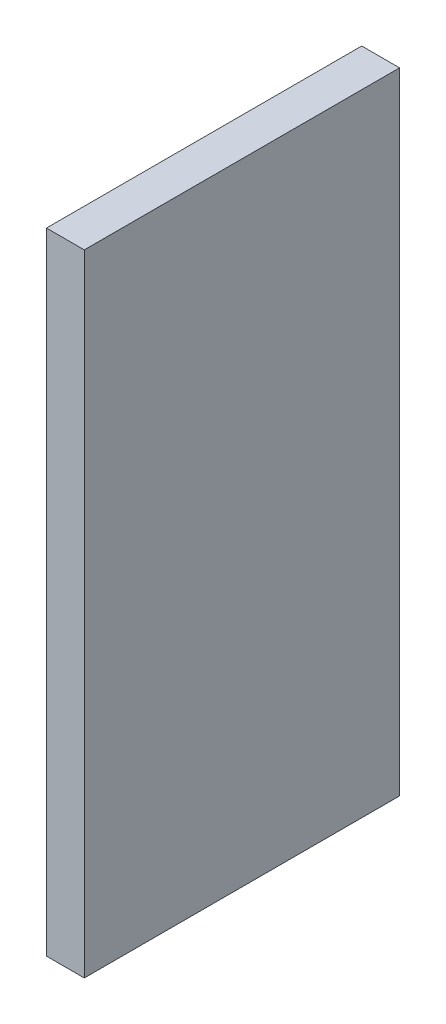
ISO-10303-21;
HEADER;
FILE_DESCRIPTION(('STEP AP214'),'2;1');
FILE_NAME('part.step','',(''),(''),'','','');
FILE_SCHEMA(('AUTOMOTIVE_DESIGN { 1 0 10303 214 1 1 1 1 }'));
ENDSEC;
DATA;
#1=APPLICATION_CONTEXT('core data for automotive mechanical design processes');
#2=APPLICATION_PROTOCOL_DEFINITION('international standard','automotive_design',2000,#1);
#3=PRODUCT_CONTEXT('',#1,'mechanical');
#4=PRODUCT('Part','Part','',(#3));
#5=PRODUCT_RELATED_PRODUCT_CATEGORY('part','',(#4));
#6=PRODUCT_DEFINITION_FORMATION('','',#4);
#7=PRODUCT_DEFINITION_CONTEXT('part definition',#1,'design');
#8=PRODUCT_DEFINITION('design','',#6,#7);
#9=PRODUCT_DEFINITION_SHAPE('','',#8);
#10=(LENGTH_UNIT() NAMED_UNIT(*) SI_UNIT(.MILLI.,.METRE.));
#11=(NAMED_UNIT(*) PLANE_ANGLE_UNIT() SI_UNIT($,.RADIAN.));
#12=(NAMED_UNIT(*) SI_UNIT($,.STERADIAN.) SOLID_ANGLE_UNIT());
#13=UNCERTAINTY_MEASURE_WITH_UNIT(LENGTH_MEASURE(1.E-05),#10,'distance_accuracy_value','');
#14=(GEOMETRIC_REPRESENTATION_CONTEXT(3) GLOBAL_UNCERTAINTY_ASSIGNED_CONTEXT((#13)) GLOBAL_UNIT_ASSIGNED_CONTEXT((#10,
#11,#12)) REPRESENTATION_CONTEXT('',''));
#15=CARTESIAN_POINT('',(0.,0.,0.));
#16=DIRECTION('',(0.,0.,1.));
#17=DIRECTION('',(1.,0.,0.));
#18=AXIS2_PLACEMENT_3D('',#15,#16,#17);
#19=CARTESIAN_POINT('',(3.,-25.,12.5));
#20=DIRECTION('',(0.,0.,-1.));
#21=DIRECTION('',(-1.,0.,0.));
#22=AXIS2_PLACEMENT_3D('',#19,#20,#21);
#23=PLANE('',#22);
#24=DIRECTION('',(0.,-1.,0.));
#25=VECTOR('',#24,1.);
#26=CARTESIAN_POINT('',(0.,-25.,12.5));
#27=LINE('',#26,#25);
#28=CARTESIAN_POINT('',(0.,25.,12.5));
#29=VERTEX_POINT('',#28);
#30=CARTESIAN_POINT('',(0.,-25.,12.5));
#31=VERTEX_POINT('',#30);
#32=EDGE_CURVE('E111',#29,#31,#27,.T.);
#33=ORIENTED_EDGE('',*,*,#32,.T.);
#34=DIRECTION('',(-1.,0.,0.));
#35=VECTOR('',#34,1.);
#36=CARTESIAN_POINT('',(3.,-25.,12.5));
#37=LINE('',#36,#35);
#38=CARTESIAN_POINT('',(3.,-25.,12.5));
#39=VERTEX_POINT('',#38);
#40=EDGE_CURVE('E11',#39,#31,#37,.T.);
#41=ORIENTED_EDGE('',*,*,#40,.F.);
#42=DIRECTION('',(0.,-1.,0.));
#43=VECTOR('',#42,1.);
#44=CARTESIAN_POINT('',(3.,-25.,12.5));
#45=LINE('',#44,#43);
#46=CARTESIAN_POINT('',(3.,25.,12.5));
#47=VERTEX_POINT('',#46);
#48=EDGE_CURVE('E95',#47,#39,#45,.T.);
#49=ORIENTED_EDGE('',*,*,#48,.F.);
#50=DIRECTION('',(-1.,0.,0.));
#51=VECTOR('',#50,1.);
#52=CARTESIAN_POINT('',(3.,25.,12.5));
#53=LINE('',#52,#51);
#54=EDGE_CURVE('E107',#47,#29,#53,.T.);
#55=ORIENTED_EDGE('',*,*,#54,.T.);
#56=EDGE_LOOP('',(#33,#41,#49,#55));
#57=FACE_BOUND('',#56,.T.);
#58=ADVANCED_FACE('F43',(#57),#23,.F.);
#59=CARTESIAN_POINT('',(3.,-25.,-12.5));
#60=DIRECTION('',(0.,1.,0.));
#61=DIRECTION('',(0.,0.,1.));
#62=AXIS2_PLACEMENT_3D('',#59,#60,#61);
#63=PLANE('',#62);
#64=DIRECTION('',(0.,0.,-1.));
#65=VECTOR('',#64,1.);
#66=CARTESIAN_POINT('',(0.,-25.,-12.5));
#67=LINE('',#66,#65);
#68=CARTESIAN_POINT('',(0.,-25.,-12.5));
#69=VERTEX_POINT('',#68);
#70=EDGE_CURVE('E100',#31,#69,#67,.T.);
#71=ORIENTED_EDGE('',*,*,#70,.T.);
#72=DIRECTION('',(-1.,0.,0.));
#73=VECTOR('',#72,1.);
#74=CARTESIAN_POINT('',(3.,-25.,-12.5));
#75=LINE('',#74,#73);
#76=CARTESIAN_POINT('',(3.,-25.,-12.5));
#77=VERTEX_POINT('',#76);
#78=EDGE_CURVE('E52',#77,#69,#75,.T.);
#79=ORIENTED_EDGE('',*,*,#78,.F.);
#80=DIRECTION('',(0.,0.,-1.));
#81=VECTOR('',#80,1.);
#82=CARTESIAN_POINT('',(3.,-25.,-12.5));
#83=LINE('',#82,#81);
#84=EDGE_CURVE('E90',#39,#77,#83,.T.);
#85=ORIENTED_EDGE('',*,*,#84,.F.);
#86=ORIENTED_EDGE('',*,*,#40,.T.);
#87=EDGE_LOOP('',(#71,#79,#85,#86));
#88=FACE_BOUND('',#87,.T.);
#89=ADVANCED_FACE('F99',(#88),#63,.F.);
#90=CARTESIAN_POINT('',(3.,-25.,-12.5));
#91=DIRECTION('',(0.,0.,1.));
#92=DIRECTION('',(1.,0.,0.));
#93=AXIS2_PLACEMENT_3D('',#90,#91,#92);
#94=PLANE('',#93);
#95=DIRECTION('',(0.,1.,0.));
#96=VECTOR('',#95,1.);
#97=CARTESIAN_POINT('',(0.,-25.,-12.5));
#98=LINE('',#97,#96);
#99=CARTESIAN_POINT('',(0.,25.,-12.5));
#100=VERTEX_POINT('',#99);
#101=EDGE_CURVE('E77',#69,#100,#98,.T.);
#102=ORIENTED_EDGE('',*,*,#101,.T.);
#103=DIRECTION('',(-1.,0.,0.));
#104=VECTOR('',#103,1.);
#105=CARTESIAN_POINT('',(3.,25.,-12.5));
#106=LINE('',#105,#104);
#107=CARTESIAN_POINT('',(3.,25.,-12.5));
#108=VERTEX_POINT('',#107);
#109=EDGE_CURVE('E102',#108,#100,#106,.T.);
#110=ORIENTED_EDGE('',*,*,#109,.F.);
#111=DIRECTION('',(0.,1.,0.));
#112=VECTOR('',#111,1.);
#113=CARTESIAN_POINT('',(3.,-25.,-12.5));
#114=LINE('',#113,#112);
#115=EDGE_CURVE('E93',#77,#108,#114,.T.);
#116=ORIENTED_EDGE('',*,*,#115,.F.);
#117=ORIENTED_EDGE('',*,*,#78,.T.);
#118=EDGE_LOOP('',(#102,#110,#116,#117));
#119=FACE_BOUND('',#118,.T.);
#120=ADVANCED_FACE('F103',(#119),#94,.F.);
#121=CARTESIAN_POINT('',(3.,25.,-12.5));
#122=DIRECTION('',(0.,-1.,0.));
#123=DIRECTION('',(0.,0.,-1.));
#124=AXIS2_PLACEMENT_3D('',#121,#122,#123);
#125=PLANE('',#124);
#126=DIRECTION('',(0.,0.,1.));
#127=VECTOR('',#126,1.);
#128=CARTESIAN_POINT('',(0.,25.,-12.5));
#129=LINE('',#128,#127);
#130=EDGE_CURVE('E83',#100,#29,#129,.T.);
#131=ORIENTED_EDGE('',*,*,#130,.T.);
#132=ORIENTED_EDGE('',*,*,#54,.F.);
#133=DIRECTION('',(0.,0.,1.));
#134=VECTOR('',#133,1.);
#135=CARTESIAN_POINT('',(3.,25.,-12.5));
#136=LINE('',#135,#134);
#137=EDGE_CURVE('E60',#108,#47,#136,.T.);
#138=ORIENTED_EDGE('',*,*,#137,.F.);
#139=ORIENTED_EDGE('',*,*,#109,.T.);
#140=EDGE_LOOP('',(#131,#132,#138,#139));
#141=FACE_BOUND('',#140,.T.);
#142=ADVANCED_FACE('F124',(#141),#125,.F.);
#143=CARTESIAN_POINT('',(3.,0.,0.));
#144=DIRECTION('',(1.,0.,0.));
#145=DIRECTION('',(0.,0.,-1.));
#146=AXIS2_PLACEMENT_3D('',#143,#144,#145);
#147=PLANE('',#146);
#148=ORIENTED_EDGE('',*,*,#48,.T.);
#149=ORIENTED_EDGE('',*,*,#84,.T.);
#150=ORIENTED_EDGE('',*,*,#115,.T.);
#151=ORIENTED_EDGE('',*,*,#137,.T.);
#152=EDGE_LOOP('',(#148,#149,#150,#151));
#153=FACE_BOUND('',#152,.T.);
#154=ADVANCED_FACE('F91',(#153),#147,.T.);
#155=CARTESIAN_POINT('',(0.,0.,0.));
#156=DIRECTION('',(1.,0.,0.));
#157=DIRECTION('',(0.,0.,-1.));
#158=AXIS2_PLACEMENT_3D('',#155,#156,#157);
#159=PLANE('',#158);
#160=ORIENTED_EDGE('',*,*,#32,.F.);
#161=ORIENTED_EDGE('',*,*,#130,.F.);
#162=ORIENTED_EDGE('',*,*,#101,.F.);
#163=ORIENTED_EDGE('',*,*,#70,.F.);
#164=EDGE_LOOP('',(#160,#161,#162,#163));
#165=FACE_BOUND('',#164,.T.);
#166=ADVANCED_FACE('F127',(#165),#159,.F.);
#167=CLOSED_SHELL('',(#58,#89,#120,#142,#154,#166));
#168=MANIFOLD_SOLID_BREP('B2',#167);
#169=ADVANCED_BREP_SHAPE_REPRESENTATION('',(#18,#168),#14);
#170=SHAPE_DEFINITION_REPRESENTATION(#9,#169);
ENDSEC;
END-ISO-10303-21;
